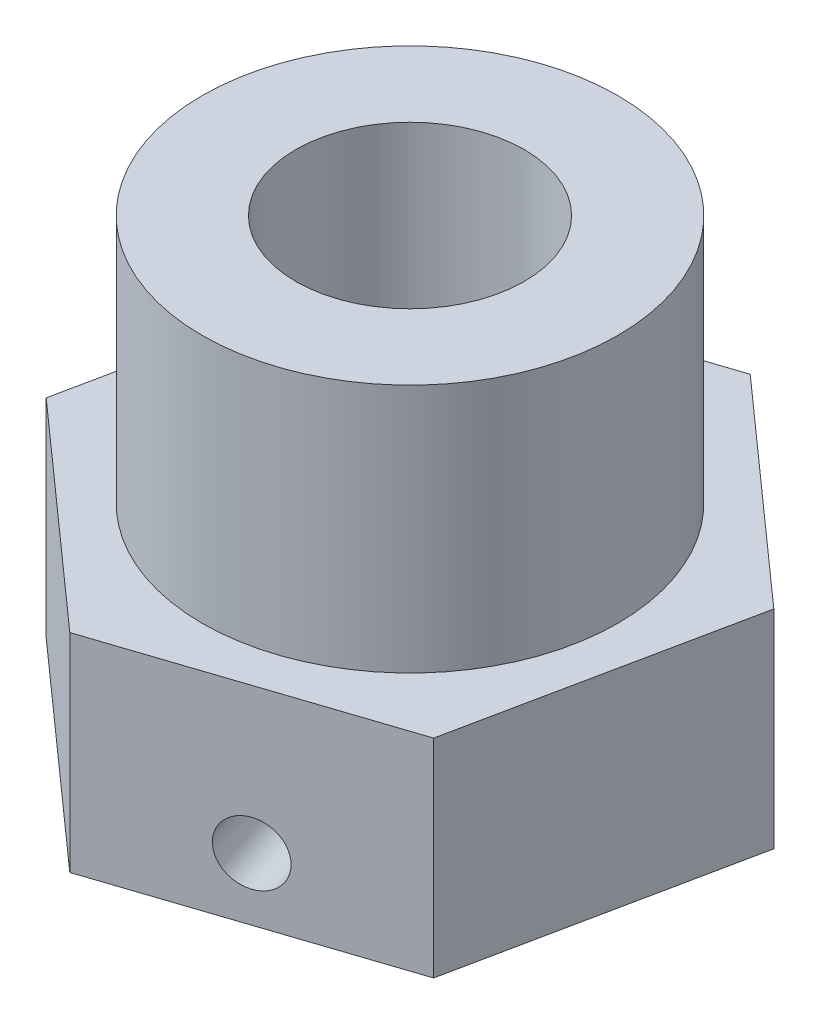
ISO-10303-21;
HEADER;
FILE_DESCRIPTION(('STEP AP214'),'2;1');
FILE_NAME('part.step','',(''),(''),'','','');
FILE_SCHEMA(('AUTOMOTIVE_DESIGN { 1 0 10303 214 1 1 1 1 }'));
ENDSEC;
DATA;
#1=APPLICATION_CONTEXT('core data for automotive mechanical design processes');
#2=APPLICATION_PROTOCOL_DEFINITION('international standard','automotive_design',2000,#1);
#3=PRODUCT_CONTEXT('',#1,'mechanical');
#4=PRODUCT('Part','Part','',(#3));
#5=PRODUCT_RELATED_PRODUCT_CATEGORY('part','',(#4));
#6=PRODUCT_DEFINITION_FORMATION('','',#4);
#7=PRODUCT_DEFINITION_CONTEXT('part definition',#1,'design');
#8=PRODUCT_DEFINITION('design','',#6,#7);
#9=PRODUCT_DEFINITION_SHAPE('','',#8);
#10=(LENGTH_UNIT() NAMED_UNIT(*) SI_UNIT(.MILLI.,.METRE.));
#11=(NAMED_UNIT(*) PLANE_ANGLE_UNIT() SI_UNIT($,.RADIAN.));
#12=(NAMED_UNIT(*) SI_UNIT($,.STERADIAN.) SOLID_ANGLE_UNIT());
#13=UNCERTAINTY_MEASURE_WITH_UNIT(LENGTH_MEASURE(1.E-05),#10,'distance_accuracy_value','');
#14=(GEOMETRIC_REPRESENTATION_CONTEXT(3) GLOBAL_UNCERTAINTY_ASSIGNED_CONTEXT((#13)) GLOBAL_UNIT_ASSIGNED_CONTEXT((#10,
#11,#12)) REPRESENTATION_CONTEXT('',''));
#15=CARTESIAN_POINT('',(0.,0.,0.));
#16=DIRECTION('',(0.,0.,1.));
#17=DIRECTION('',(1.,0.,0.));
#18=AXIS2_PLACEMENT_3D('',#15,#16,#17);
#19=CARTESIAN_POINT('',(0.,5.,0.));
#20=DIRECTION('',(0.,1.,0.));
#21=DIRECTION('',(0.,0.,1.));
#22=AXIS2_PLACEMENT_3D('',#19,#20,#21);
#23=PLANE('',#22);
#24=CARTESIAN_POINT('',(0.,5.,0.));
#25=DIRECTION('',(0.,1.,0.));
#26=DIRECTION('',(0.,0.,1.));
#27=AXIS2_PLACEMENT_3D('',#24,#25,#26);
#28=CIRCLE('',#27,5.);
#29=CARTESIAN_POINT('',(0.,5.,5.));
#30=VERTEX_POINT('',#29);
#31=EDGE_CURVE('E11',#30,#30,#28,.T.);
#32=ORIENTED_EDGE('',*,*,#31,.F.);
#33=EDGE_LOOP('',(#32));
#34=FACE_BOUND('',#33,.T.);
#35=DIRECTION('',(-0.74695648255287,0.,-0.664872930094348));
#36=VECTOR('',#35,1.);
#37=CARTESIAN_POINT('',(6.5767707382151,5.,-2.17855150431602));
#38=LINE('',#37,#36);
#39=CARTESIAN_POINT('',(6.5767707382151,5.,-2.17855150431602));
#40=VERTEX_POINT('',#39);
#41=CARTESIAN_POINT('',(1.40170442291707,5.,-6.78492628631842));
#42=VERTEX_POINT('',#41);
#43=EDGE_CURVE('E139',#40,#42,#38,.T.);
#44=ORIENTED_EDGE('',*,*,#43,.T.);
#45=DIRECTION('',(-0.949275089026735,0.,0.31444682436508));
#46=VECTOR('',#45,1.);
#47=CARTESIAN_POINT('',(1.40170442291707,5.,-6.78492628631842));
#48=LINE('',#47,#46);
#49=CARTESIAN_POINT('',(-5.17506631529803,5.,-4.6063747820024));
#50=VERTEX_POINT('',#49);
#51=EDGE_CURVE('E98',#42,#50,#48,.T.);
#52=ORIENTED_EDGE('',*,*,#51,.T.);
#53=DIRECTION('',(-0.202318606473865,0.,0.979319754459428));
#54=VECTOR('',#53,1.);
#55=CARTESIAN_POINT('',(-5.17506631529803,5.,-4.6063747820024));
#56=LINE('',#55,#54);
#57=CARTESIAN_POINT('',(-6.5767707382151,5.,2.17855150431602));
#58=VERTEX_POINT('',#57);
#59=EDGE_CURVE('E110',#50,#58,#56,.T.);
#60=ORIENTED_EDGE('',*,*,#59,.T.);
#61=DIRECTION('',(0.746956482552871,0.,0.664872930094348));
#62=VECTOR('',#61,1.);
#63=CARTESIAN_POINT('',(-6.5767707382151,5.,2.17855150431602));
#64=LINE('',#63,#62);
#65=CARTESIAN_POINT('',(-1.40170442291707,5.,6.78492628631842));
#66=VERTEX_POINT('',#65);
#67=EDGE_CURVE('E105',#58,#66,#64,.T.);
#68=ORIENTED_EDGE('',*,*,#67,.T.);
#69=DIRECTION('',(0.949275089026736,0.,-0.31444682436508));
#70=VECTOR('',#69,1.);
#71=CARTESIAN_POINT('',(-1.40170442291707,5.,6.78492628631842));
#72=LINE('',#71,#70);
#73=CARTESIAN_POINT('',(5.17506631529803,5.,4.6063747820024));
#74=VERTEX_POINT('',#73);
#75=EDGE_CURVE('E108',#66,#74,#72,.T.);
#76=ORIENTED_EDGE('',*,*,#75,.T.);
#77=DIRECTION('',(0.202318606473865,0.,-0.979319754459428));
#78=VECTOR('',#77,1.);
#79=CARTESIAN_POINT('',(5.17506631529803,5.,4.6063747820024));
#80=LINE('',#79,#78);
#81=EDGE_CURVE('E60',#74,#40,#80,.T.);
#82=ORIENTED_EDGE('',*,*,#81,.T.);
#83=EDGE_LOOP('',(#44,#52,#60,#68,#76,#82));
#84=FACE_BOUND('',#83,.T.);
#85=ADVANCED_FACE('F36',(#34,#84),#23,.T.);
#86=CARTESIAN_POINT('',(0.,0.,0.));
#87=DIRECTION('',(0.,1.,0.));
#88=DIRECTION('',(0.,0.,1.));
#89=AXIS2_PLACEMENT_3D('',#86,#87,#88);
#90=PLANE('',#89);
#91=DIRECTION('',(-0.74695648255287,0.,-0.664872930094348));
#92=VECTOR('',#91,1.);
#93=CARTESIAN_POINT('',(6.5767707382151,0.,-2.17855150431602));
#94=LINE('',#93,#92);
#95=CARTESIAN_POINT('',(6.5767707382151,0.,-2.17855150431602));
#96=VERTEX_POINT('',#95);
#97=CARTESIAN_POINT('',(1.40170442291707,0.,-6.78492628631842));
#98=VERTEX_POINT('',#97);
#99=EDGE_CURVE('E128',#96,#98,#94,.T.);
#100=ORIENTED_EDGE('',*,*,#99,.F.);
#101=DIRECTION('',(0.202318606473865,0.,-0.979319754459428));
#102=VECTOR('',#101,1.);
#103=CARTESIAN_POINT('',(5.17506631529803,0.,4.6063747820024));
#104=LINE('',#103,#102);
#105=CARTESIAN_POINT('',(5.17506631529803,0.,4.6063747820024));
#106=VERTEX_POINT('',#105);
#107=EDGE_CURVE('E89',#106,#96,#104,.T.);
#108=ORIENTED_EDGE('',*,*,#107,.F.);
#109=DIRECTION('',(0.949275089026736,0.,-0.31444682436508));
#110=VECTOR('',#109,1.);
#111=CARTESIAN_POINT('',(-1.40170442291707,0.,6.78492628631842));
#112=LINE('',#111,#110);
#113=CARTESIAN_POINT('',(-1.40170442291707,0.,6.78492628631842));
#114=VERTEX_POINT('',#113);
#115=EDGE_CURVE('E83',#114,#106,#112,.T.);
#116=ORIENTED_EDGE('',*,*,#115,.F.);
#117=DIRECTION('',(0.746956482552871,0.,0.664872930094348));
#118=VECTOR('',#117,1.);
#119=CARTESIAN_POINT('',(-6.5767707382151,0.,2.17855150431602));
#120=LINE('',#119,#118);
#121=CARTESIAN_POINT('',(-6.5767707382151,0.,2.17855150431602));
#122=VERTEX_POINT('',#121);
#123=EDGE_CURVE('E118',#122,#114,#120,.T.);
#124=ORIENTED_EDGE('',*,*,#123,.F.);
#125=DIRECTION('',(-0.202318606473865,0.,0.979319754459428));
#126=VECTOR('',#125,1.);
#127=CARTESIAN_POINT('',(-5.17506631529803,0.,-4.6063747820024));
#128=LINE('',#127,#126);
#129=CARTESIAN_POINT('',(-5.17506631529803,0.,-4.6063747820024));
#130=VERTEX_POINT('',#129);
#131=EDGE_CURVE('E134',#130,#122,#128,.T.);
#132=ORIENTED_EDGE('',*,*,#131,.F.);
#133=DIRECTION('',(-0.949275089026735,0.,0.31444682436508));
#134=VECTOR('',#133,1.);
#135=CARTESIAN_POINT('',(1.40170442291707,0.,-6.78492628631842));
#136=LINE('',#135,#134);
#137=EDGE_CURVE('E131',#98,#130,#136,.T.);
#138=ORIENTED_EDGE('',*,*,#137,.F.);
#139=EDGE_LOOP('',(#100,#108,#116,#124,#132,#138));
#140=FACE_BOUND('',#139,.T.);
#141=CARTESIAN_POINT('',(0.,0.,0.));
#142=DIRECTION('',(0.,1.,0.));
#143=DIRECTION('',(0.,0.,1.));
#144=AXIS2_PLACEMENT_3D('',#141,#142,#143);
#145=CIRCLE('',#144,2.75);
#146=CARTESIAN_POINT('',(0.,0.,2.75));
#147=VERTEX_POINT('',#146);
#148=EDGE_CURVE('E132',#147,#147,#145,.T.);
#149=ORIENTED_EDGE('',*,*,#148,.T.);
#150=EDGE_LOOP('',(#149));
#151=FACE_BOUND('',#150,.T.);
#152=ADVANCED_FACE('F174',(#140,#151),#90,.F.);
#153=CARTESIAN_POINT('',(6.5767707382151,5.,-2.17855150431602));
#154=DIRECTION('',(-0.664872930094348,0.,0.74695648255287));
#155=DIRECTION('',(0.746956482552871,0.,0.664872930094348));
#156=AXIS2_PLACEMENT_3D('',#153,#154,#155);
#157=PLANE('',#156);
#158=ORIENTED_EDGE('',*,*,#99,.T.);
#159=DIRECTION('',(0.,-1.,0.));
#160=VECTOR('',#159,1.);
#161=CARTESIAN_POINT('',(1.40170442291707,5.,-6.78492628631842));
#162=LINE('',#161,#160);
#163=EDGE_CURVE('E51',#42,#98,#162,.T.);
#164=ORIENTED_EDGE('',*,*,#163,.F.);
#165=ORIENTED_EDGE('',*,*,#43,.F.);
#166=DIRECTION('',(0.,-1.,0.));
#167=VECTOR('',#166,1.);
#168=CARTESIAN_POINT('',(6.5767707382151,5.,-2.17855150431602));
#169=LINE('',#168,#167);
#170=EDGE_CURVE('E124',#40,#96,#169,.T.);
#171=ORIENTED_EDGE('',*,*,#170,.T.);
#172=EDGE_LOOP('',(#158,#164,#165,#171));
#173=FACE_BOUND('',#172,.T.);
#174=ADVANCED_FACE('F38',(#173),#157,.F.);
#175=CARTESIAN_POINT('',(1.40170442291707,5.,-6.78492628631842));
#176=DIRECTION('',(0.31444682436508,0.,0.949275089026736));
#177=DIRECTION('',(0.949275089026736,0.,-0.31444682436508));
#178=AXIS2_PLACEMENT_3D('',#175,#176,#177);
#179=PLANE('',#178);
#180=CARTESIAN_POINT('',(-1.88668094619048,1.5,-5.69565053416041));
#181=DIRECTION('',(0.31444682436508,0.,0.949275089026736));
#182=DIRECTION('',(0.949275089026736,0.,-0.31444682436508));
#183=AXIS2_PLACEMENT_3D('',#180,#181,#182);
#184=CIRCLE('',#183,0.75);
#185=CARTESIAN_POINT('',(-1.17472462942043,1.5,-5.93148565243422));
#186=VERTEX_POINT('',#185);
#187=EDGE_CURVE('E203',#186,#186,#184,.T.);
#188=ORIENTED_EDGE('',*,*,#187,.T.);
#189=EDGE_LOOP('',(#188));
#190=FACE_BOUND('',#189,.T.);
#191=ORIENTED_EDGE('',*,*,#137,.T.);
#192=DIRECTION('',(0.,-1.,0.));
#193=VECTOR('',#192,1.);
#194=CARTESIAN_POINT('',(-5.17506631529803,5.,-4.6063747820024));
#195=LINE('',#194,#193);
#196=EDGE_CURVE('E143',#50,#130,#195,.T.);
#197=ORIENTED_EDGE('',*,*,#196,.F.);
#198=ORIENTED_EDGE('',*,*,#51,.F.);
#199=ORIENTED_EDGE('',*,*,#163,.T.);
#200=EDGE_LOOP('',(#191,#197,#198,#199));
#201=FACE_BOUND('',#200,.T.);
#202=ADVANCED_FACE('F193',(#190,#201),#179,.F.);
#203=CARTESIAN_POINT('',(-5.17506631529803,5.,-4.6063747820024));
#204=DIRECTION('',(0.979319754459428,0.,0.202318606473865));
#205=DIRECTION('',(0.202318606473865,0.,-0.979319754459428));
#206=AXIS2_PLACEMENT_3D('',#203,#204,#205);
#207=PLANE('',#206);
#208=ORIENTED_EDGE('',*,*,#131,.T.);
#209=DIRECTION('',(0.,-1.,0.));
#210=VECTOR('',#209,1.);
#211=CARTESIAN_POINT('',(-6.5767707382151,5.,2.17855150431602));
#212=LINE('',#211,#210);
#213=EDGE_CURVE('E119',#58,#122,#212,.T.);
#214=ORIENTED_EDGE('',*,*,#213,.F.);
#215=ORIENTED_EDGE('',*,*,#59,.F.);
#216=ORIENTED_EDGE('',*,*,#196,.T.);
#217=EDGE_LOOP('',(#208,#214,#215,#216));
#218=FACE_BOUND('',#217,.T.);
#219=ADVANCED_FACE('F191',(#218),#207,.F.);
#220=CARTESIAN_POINT('',(-6.5767707382151,5.,2.17855150431602));
#221=DIRECTION('',(0.664872930094348,0.,-0.746956482552871));
#222=DIRECTION('',(-0.746956482552871,0.,-0.664872930094348));
#223=AXIS2_PLACEMENT_3D('',#220,#221,#222);
#224=PLANE('',#223);
#225=ORIENTED_EDGE('',*,*,#123,.T.);
#226=DIRECTION('',(0.,-1.,0.));
#227=VECTOR('',#226,1.);
#228=CARTESIAN_POINT('',(-1.40170442291707,5.,6.78492628631842));
#229=LINE('',#228,#227);
#230=EDGE_CURVE('E115',#66,#114,#229,.T.);
#231=ORIENTED_EDGE('',*,*,#230,.F.);
#232=ORIENTED_EDGE('',*,*,#67,.F.);
#233=ORIENTED_EDGE('',*,*,#213,.T.);
#234=EDGE_LOOP('',(#225,#231,#232,#233));
#235=FACE_BOUND('',#234,.T.);
#236=ADVANCED_FACE('F116',(#235),#224,.F.);
#237=CARTESIAN_POINT('',(-1.40170442291707,5.,6.78492628631842));
#238=DIRECTION('',(-0.31444682436508,0.,-0.949275089026736));
#239=DIRECTION('',(-0.949275089026735,0.,0.31444682436508));
#240=AXIS2_PLACEMENT_3D('',#237,#238,#239);
#241=PLANE('',#240);
#242=CARTESIAN_POINT('',(1.88668094619048,1.5,5.69565053416041));
#243=DIRECTION('',(0.31444682436508,0.,0.949275089026736));
#244=DIRECTION('',(0.949275089026735,0.,-0.31444682436508));
#245=AXIS2_PLACEMENT_3D('',#242,#243,#244);
#246=CIRCLE('',#245,0.75);
#247=CARTESIAN_POINT('',(2.59863726296053,1.5,5.4598154158866));
#248=VERTEX_POINT('',#247);
#249=EDGE_CURVE('E151',#248,#248,#246,.T.);
#250=ORIENTED_EDGE('',*,*,#249,.F.);
#251=EDGE_LOOP('',(#250));
#252=FACE_BOUND('',#251,.T.);
#253=ORIENTED_EDGE('',*,*,#115,.T.);
#254=DIRECTION('',(0.,-1.,0.));
#255=VECTOR('',#254,1.);
#256=CARTESIAN_POINT('',(5.17506631529803,5.,4.6063747820024));
#257=LINE('',#256,#255);
#258=EDGE_CURVE('E120',#74,#106,#257,.T.);
#259=ORIENTED_EDGE('',*,*,#258,.F.);
#260=ORIENTED_EDGE('',*,*,#75,.F.);
#261=ORIENTED_EDGE('',*,*,#230,.T.);
#262=EDGE_LOOP('',(#253,#259,#260,#261));
#263=FACE_BOUND('',#262,.T.);
#264=ADVANCED_FACE('F122',(#252,#263),#241,.F.);
#265=CARTESIAN_POINT('',(5.17506631529803,5.,4.6063747820024));
#266=DIRECTION('',(-0.979319754459428,0.,-0.202318606473865));
#267=DIRECTION('',(-0.202318606473865,0.,0.979319754459428));
#268=AXIS2_PLACEMENT_3D('',#265,#266,#267);
#269=PLANE('',#268);
#270=ORIENTED_EDGE('',*,*,#107,.T.);
#271=ORIENTED_EDGE('',*,*,#170,.F.);
#272=ORIENTED_EDGE('',*,*,#81,.F.);
#273=ORIENTED_EDGE('',*,*,#258,.T.);
#274=EDGE_LOOP('',(#270,#271,#272,#273));
#275=FACE_BOUND('',#274,.T.);
#276=ADVANCED_FACE('F183',(#275),#269,.F.);
#277=CARTESIAN_POINT('',(0.,5.,0.));
#278=DIRECTION('',(0.,-1.,0.));
#279=DIRECTION('',(0.,0.,-1.));
#280=AXIS2_PLACEMENT_3D('',#277,#278,#279);
#281=CYLINDRICAL_SURFACE('',#280,2.75);
#282=CARTESIAN_POINT('',(-0.119991781053955,1.5,-2.74738092962725));
#283=CARTESIAN_POINT('',(-0.119992869265209,1.54127822550266,-2.74738128421438));
#284=CARTESIAN_POINT('',(-0.123544807204557,1.58256605494395,-2.74723275563));
#285=CARTESIAN_POINT('',(-0.13760367134907,1.66394676261868,-2.7465638811396));
#286=CARTESIAN_POINT('',(-0.148113878919327,1.70403906774304,-2.74604335980087));
#287=CARTESIAN_POINT('',(-0.175639975036804,1.78183959399195,-2.74441959397495));
#288=CARTESIAN_POINT('',(-0.192646429255946,1.81955118045507,-2.743317193653));
#289=CARTESIAN_POINT('',(-0.232539712276566,1.8916790671154,-2.74022333642707));
#290=CARTESIAN_POINT('',(-0.255427074291777,1.92609506811785,-2.73823179889417));
#291=CARTESIAN_POINT('',(-0.306934429047363,1.99155510339649,-2.73294264770961));
#292=CARTESIAN_POINT('',(-0.335677175534498,2.02250016418924,-2.72961526488655));
#293=CARTESIAN_POINT('',(-0.397638700541994,2.07926382886253,-2.72127895769866));
#294=CARTESIAN_POINT('',(-0.430857960629335,2.10508188045795,-2.71626985233369));
#295=CARTESIAN_POINT('',(-0.501369532363693,2.1512743134053,-2.70415007495862));
#296=CARTESIAN_POINT('',(-0.538720939174285,2.17154986091324,-2.69700548182245));
#297=CARTESIAN_POINT('',(-0.615864036662647,2.20543643409142,-2.68044126685463));
#298=CARTESIAN_POINT('',(-0.655655294777948,2.21904863728711,-2.6710220474275));
#299=CARTESIAN_POINT('',(-0.735449840406022,2.23890054914027,-2.65014582460092));
#300=CARTESIAN_POINT('',(-0.775425319576893,2.24530872210737,-2.6387429183296));
#301=CARTESIAN_POINT('',(-0.85526744812151,2.25110115114898,-2.61395554035008));
#302=CARTESIAN_POINT('',(-0.895134115296764,2.25048663477224,-2.60057141535773));
#303=CARTESIAN_POINT('',(-0.972526575715359,2.2423688006758,-2.57261374168804));
#304=CARTESIAN_POINT('',(-1.0100863752855,2.23504756334037,-2.5580808638574));
#305=CARTESIAN_POINT('',(-1.08297773423876,2.21401883382721,-2.52808494485594));
#306=CARTESIAN_POINT('',(-1.11830916358088,2.20031096933583,-2.5126218495031));
#307=CARTESIAN_POINT('',(-1.186248296024,2.16676143207849,-2.48127593574512));
#308=CARTESIAN_POINT('',(-1.2188243381057,2.14685827565615,-2.4653904388533));
#309=CARTESIAN_POINT('',(-1.28014911455977,2.1015305528663,-2.43411276900692));
#310=CARTESIAN_POINT('',(-1.30889707158076,2.07610486781433,-2.41872069673015));
#311=CARTESIAN_POINT('',(-1.36285487408932,2.01949100243957,-2.38874667940729));
#312=CARTESIAN_POINT('',(-1.3879216792516,1.98814416402961,-2.37420654774224));
#313=CARTESIAN_POINT('',(-1.43287053242837,1.92107739244333,-2.34735371334807));
#314=CARTESIAN_POINT('',(-1.45275223354111,1.88535716690681,-2.33504115966862));
#315=CARTESIAN_POINT('',(-1.48701892846695,1.81022280299982,-2.31337207058945));
#316=CARTESIAN_POINT('',(-1.50136616280616,1.7707854971129,-2.30403591436777));
#317=CARTESIAN_POINT('',(-1.52401920565015,1.68953869888545,-2.28911587684208));
#318=CARTESIAN_POINT('',(-1.53232659203611,1.64772982918359,-2.2835310155594));
#319=CARTESIAN_POINT('',(-1.54251785927161,1.56432390924501,-2.27665885108003));
#320=CARTESIAN_POINT('',(-1.54459396312968,1.52276090661795,-2.27524296989584));
#321=CARTESIAN_POINT('',(-1.54281344024978,1.43982442822897,-2.27645072973789));
#322=CARTESIAN_POINT('',(-1.5389574781015,1.39845093175686,-2.27907391825334));
#323=CARTESIAN_POINT('',(-1.52555654507853,1.31793878134432,-2.28806456159513));
#324=CARTESIAN_POINT('',(-1.51612886148623,1.27877178968511,-2.2943547875644));
#325=CARTESIAN_POINT('',(-1.49190663516648,1.20282699503469,-2.31017802832437));
#326=CARTESIAN_POINT('',(-1.47711136805495,1.16604951531116,-2.31971148079499));
#327=CARTESIAN_POINT('',(-1.44207218021366,1.09499964591651,-2.34165822741856));
#328=CARTESIAN_POINT('',(-1.42171146804599,1.06080371274751,-2.35413235582387));
#329=CARTESIAN_POINT('',(-1.37611171606809,0.99671696730743,-2.38107465444924));
#330=CARTESIAN_POINT('',(-1.35087171547881,0.966827004949937,-2.39554321723144));
#331=CARTESIAN_POINT('',(-1.29516171178115,0.9112668180247,-2.42612743599771));
#332=CARTESIAN_POINT('',(-1.26455604136095,0.885752498282901,-2.44227979256291));
#333=CARTESIAN_POINT('',(-1.19933233722458,0.840814682454508,-2.47496069966509));
#334=CARTESIAN_POINT('',(-1.16471451710039,0.821390862336091,-2.49148923013836));
#335=CARTESIAN_POINT('',(-1.09256622078633,0.789366466871042,-2.523955295243));
#336=CARTESIAN_POINT('',(-1.05506019777867,0.776714554849753,-2.53989639795164));
#337=CARTESIAN_POINT('',(-0.977909991627748,0.758446523727461,-2.57058618300017));
#338=CARTESIAN_POINT('',(-0.938266308064048,0.752828768086536,-2.5853351419524));
#339=CARTESIAN_POINT('',(-0.859298779096201,0.748894939954714,-2.61262229798927));
#340=CARTESIAN_POINT('',(-0.820005390489926,0.750350664346646,-2.62521619157428));
#341=CARTESIAN_POINT('',(-0.741661080741619,0.759989888654994,-2.64841612711077));
#342=CARTESIAN_POINT('',(-0.702610149803954,0.76817311496514,-2.65902224988298));
#343=CARTESIAN_POINT('',(-0.626195119817657,0.790903685169736,-2.67804404341428));
#344=CARTESIAN_POINT('',(-0.58882056805343,0.805402849120119,-2.68647554244787));
#345=CARTESIAN_POINT('',(-0.516509920481432,0.840310810767553,-2.70131106356245));
#346=CARTESIAN_POINT('',(-0.48157417938673,0.860720465903311,-2.70771479119099));
#347=CARTESIAN_POINT('',(-0.414199209762214,0.907527364140849,-2.71884866716589));
#348=CARTESIAN_POINT('',(-0.381855696918452,0.934074536218315,-2.72352765534615));
#349=CARTESIAN_POINT('',(-0.321730745206212,0.992121069275122,-2.731283626406));
#350=CARTESIAN_POINT('',(-0.293950527532646,1.02362175147567,-2.73436018093092));
#351=CARTESIAN_POINT('',(-0.243246337046108,1.09156376341543,-2.73934240011358));
#352=CARTESIAN_POINT('',(-0.220450583063217,1.12810310134028,-2.74121911564379));
#353=CARTESIAN_POINT('',(-0.181399987546301,1.20454297257493,-2.74408088739596));
#354=CARTESIAN_POINT('',(-0.165141056125258,1.24444138525562,-2.74506650163596));
#355=CARTESIAN_POINT('',(-0.141763456630668,1.32013400962588,-2.74636443035562));
#356=CARTESIAN_POINT('',(-0.133622884239281,1.35561423437439,-2.74675704927633));
#357=CARTESIAN_POINT('',(-0.122736909229243,1.42739389895273,-2.74726512543518));
#358=CARTESIAN_POINT('',(-0.119990823904507,1.46369323453073,-2.74738061774583));
#359=CARTESIAN_POINT('',(-0.119991781053955,1.5,-2.74738092962725));
#360=B_SPLINE_CURVE_WITH_KNOTS('',3,(#282,#283,#284,#285,#286,#287,#288,#289,#290,#291,#292,
#293,#294,#295,#296,#297,#298,#299,#300,#301,#302,#303,#304,#305,#306,#307,#308,#309,#310,#311,
#312,#313,#314,#315,#316,#317,#318,#319,#320,#321,#322,#323,#324,#325,#326,#327,#328,#329,#330,
#331,#332,#333,#334,#335,#336,#337,#338,#339,#340,#341,#342,#343,#344,#345,#346,#347,#348,#349,
#350,#351,#352,#353,#354,#355,#356,#357,#358,#359),.UNSPECIFIED.,.T.,.F.,(4,2,2,2,2,2,2,2,2,2,2,
2,2,2,2,2,2,2,2,2,2,2,2,2,2,2,2,2,2,2,2,2,2,2,2,2,2,2,4),(0.,0.12370110067969,0.247460577636812,
0.371041001114147,0.494632633412867,0.621146634972569,0.747674257327461,0.876329414066369,
1.00496182705167,1.13051921507375,1.25605465631036,1.37827981189676,1.50051209359009,
1.62399834853403,1.74750964113961,1.87498208429956,2.00246305362873,2.13079900912157,
2.25910142540551,2.38340305767265,2.50769076501635,2.62945093720513,2.75122754769593,
2.87578712741458,3.00037125914755,3.12874278335119,3.25710747666703,3.38448475880956,
3.51183240033097,3.63509938017071,3.75836134701295,3.88069906276589,4.00305453502713,
4.12879252694222,4.25456411329071,4.38326590609935,4.51188704840582,4.62070362887508,
4.72950643703791),.UNSPECIFIED.);
#361=CARTESIAN_POINT('',(-0.119991781053955,1.5,-2.74738092962725));
#362=VERTEX_POINT('',#361);
#363=EDGE_CURVE('E40',#362,#362,#360,.T.);
#364=ORIENTED_EDGE('',*,*,#363,.F.);
#365=EDGE_LOOP('',(#364));
#366=FACE_BOUND('',#365,.T.);
#367=CARTESIAN_POINT('',(1.54390441459406,1.5,2.27571069307963));
#368=CARTESIAN_POINT('',(1.54390375326657,1.45872177449734,2.27571162720046));
#369=CARTESIAN_POINT('',(1.54096555334351,1.41743394505605,2.27771295303037));
#370=CARTESIAN_POINT('',(1.52928756690761,1.33605323738132,2.28556939541358));
#371=CARTESIAN_POINT('',(1.52054504319935,1.29596093225696,2.29142633017884));
#372=CARTESIAN_POINT('',(1.49749295502526,1.21816040600805,2.30655655865497));
#373=CARTESIAN_POINT('',(1.48319146317587,1.18044881954493,2.31582489736584));
#374=CARTESIAN_POINT('',(1.44934020957849,1.1083209328846,2.3371588752552));
#375=CARTESIAN_POINT('',(1.42978997192681,1.07390493188215,2.34922476807435));
#376=CARTESIAN_POINT('',(1.38531079592552,1.00844489660351,2.37573109970317));
#377=CARTESIAN_POINT('',(1.36026560683664,0.977499835810756,2.39022093943924));
#378=CARTESIAN_POINT('',(1.30558047946713,0.920736171137474,2.42052376840563));
#379=CARTESIAN_POINT('',(1.2759400467953,0.894918119542053,2.43633689992139));
#380=CARTESIAN_POINT('',(1.21213696981198,0.8487256865947,2.46870877227272));
#381=CARTESIAN_POINT('',(1.17790666594155,0.82845013908676,2.48527557941079));
#382=CARTESIAN_POINT('',(1.10613017290416,0.794563565908583,2.51804089269866));
#383=CARTESIAN_POINT('',(1.06858457099159,0.780951362712895,2.53423946343925));
#384=CARTESIAN_POINT('',(0.992106724429343,0.761099450859726,2.56512838016834));
#385=CARTESIAN_POINT('',(0.953229084532376,0.754691277892633,2.57984552399502));
#386=CARTESIAN_POINT('',(0.874378132207979,0.748898848851024,2.60762513729632));
#387=CARTESIAN_POINT('',(0.834405012486308,0.749513365227762,2.62068789554986));
#388=CARTESIAN_POINT('',(0.755626653000188,0.757631199324198,2.64446171567496));
#389=CARTESIAN_POINT('',(0.716818411996659,0.764952436659629,2.655225707128));
#390=CARTESIAN_POINT('',(0.640434226561974,0.785981166172793,2.67467722589328));
#391=CARTESIAN_POINT('',(0.602858354109463,0.79968903066417,2.68336463210459));
#392=CARTESIAN_POINT('',(0.529641136991403,0.83323856792151,2.69877667752152));
#393=CARTESIAN_POINT('',(0.494023593226277,0.85314172434385,2.70548026651163));
#394=CARTESIAN_POINT('',(0.426153460460539,0.8984694471337,2.71699833564325));
#395=CARTESIAN_POINT('',(0.393901555191191,0.923895132185671,2.72181243247976));
#396=CARTESIAN_POINT('',(0.332719822201195,0.980508997560429,2.72997831971662));
#397=CARTESIAN_POINT('',(0.303929710363931,1.01185583597039,2.73327826066736));
#398=CARTESIAN_POINT('',(0.251838699039015,1.07892260755667,2.73856982528049));
#399=CARTESIAN_POINT('',(0.22853816683366,1.11464283309319,2.74056136141952));
#400=CARTESIAN_POINT('',(0.188111538447855,1.18977719700018,2.74363439249932));
#401=CARTESIAN_POINT('',(0.171027900897141,1.2292145028871,2.74470969441771));
#402=CARTESIAN_POINT('',(0.143947419996615,1.31046130111455,2.74626385787625));
#403=CARTESIAN_POINT('',(0.133948725756847,1.35227017081641,2.74674287521618));
#404=CARTESIAN_POINT('',(0.121670183814602,1.43567609075499,2.7473138220348));
#405=CARTESIAN_POINT('',(0.119159365729561,1.47723909338205,2.74741735609208));
#406=CARTESIAN_POINT('',(0.121308808042231,1.56017557177103,2.74732331723641));
#407=CARTESIAN_POINT('',(0.125968265129478,1.60154906824314,2.74712577805375));
#408=CARTESIAN_POINT('',(0.142086467069649,1.68206121865568,2.7463382250071));
#409=CARTESIAN_POINT('',(0.153405013530953,1.7212282103149,2.74575627426667));
#410=CARTESIAN_POINT('',(0.18228357228468,1.79717300496531,2.74398991067415));
#411=CARTESIAN_POINT('',(0.199844427003487,1.83395048468884,2.74280541649693));
#412=CARTESIAN_POINT('',(0.241056544672534,1.90500035408349,2.73949396225904));
#413=CARTESIAN_POINT('',(0.264837820759467,1.93919628725249,2.73734608257811));
#414=CARTESIAN_POINT('',(0.317504422823816,2.00328303269257,2.73173770824502));
#415=CARTESIAN_POINT('',(0.346390753939637,2.03317299505006,2.72827695494599));
#416=CARTESIAN_POINT('',(0.409342470042599,2.0887331819753,2.71955454763903));
#417=CARTESIAN_POINT('',(0.443538603633553,2.1142475017171,2.71424134409422));
#418=CARTESIAN_POINT('',(0.515374359977975,2.15918531754549,2.70152138416053));
#419=CARTESIAN_POINT('',(0.553013799400148,2.17860913766391,2.69411473918853));
#420=CARTESIAN_POINT('',(0.630276525631834,2.21063353312896,2.677088489465));
#421=CARTESIAN_POINT('',(0.669882325081628,2.22328544515025,2.667486345571));
#422=CARTESIAN_POINT('',(0.750097388527835,2.24155347627254,2.64604897605476));
#423=CARTESIAN_POINT('',(0.790706416874003,2.24717123191347,2.63421427058933));
#424=CARTESIAN_POINT('',(0.870348075033599,2.25110506004529,2.60896222509875));
#425=CARTESIAN_POINT('',(0.909389521415904,2.24964933565335,2.59560774988735));
#426=CARTESIAN_POINT('',(0.986091161874673,2.24001011134501,2.567448804066));
#427=CARTESIAN_POINT('',(1.02375141205907,2.23182688503486,2.55264439244627));
#428=CARTESIAN_POINT('',(1.09641097295392,2.20909631483026,2.52228531394376));
#429=CARTESIAN_POINT('',(1.13142811868798,2.19459715087988,2.50673710503824));
#430=CARTESIAN_POINT('',(1.19829577797041,2.15968918923245,2.47546989248081));
#431=CARTESIAN_POINT('',(1.23014583116542,2.13927953409669,2.45975086436672));
#432=CARTESIAN_POINT('',(1.29084400412354,2.09247263585915,2.42846058591358));
#433=CARTESIAN_POINT('',(1.31958479405827,2.06592546378168,2.41290543411767));
#434=CARTESIAN_POINT('',(1.37245008048373,2.00787893072488,2.38323345412586));
#435=CARTESIAN_POINT('',(1.39657334155048,1.97637824852433,2.36911701132886));
#436=CARTESIAN_POINT('',(1.44022494563747,1.90843623658457,2.34284392811598));
#437=CARTESIAN_POINT('',(1.4596331431356,1.87189689865972,2.33074060912061));
#438=CARTESIAN_POINT('',(1.49266980030533,1.79545702742507,2.3097235201015));
#439=CARTESIAN_POINT('',(1.50630187420692,1.75555861474438,2.30080775611149));
#440=CARTESIAN_POINT('',(1.52583132344849,1.67986599037412,2.28789274974633));
#441=CARTESIAN_POINT('',(1.5325964590328,1.64438576562561,2.28334786151864));
#442=CARTESIAN_POINT('',(1.54163301112663,1.57260610104727,2.27725661209362));
#443=CARTESIAN_POINT('',(1.5439049962727,1.53630676546927,2.2757098714623));
#444=CARTESIAN_POINT('',(1.54390441459406,1.5,2.27571069307963));
#445=B_SPLINE_CURVE_WITH_KNOTS('',3,(#367,#368,#369,#370,#371,#372,#373,#374,#375,#376,#377,
#378,#379,#380,#381,#382,#383,#384,#385,#386,#387,#388,#389,#390,#391,#392,#393,#394,#395,#396,
#397,#398,#399,#400,#401,#402,#403,#404,#405,#406,#407,#408,#409,#410,#411,#412,#413,#414,#415,
#416,#417,#418,#419,#420,#421,#422,#423,#424,#425,#426,#427,#428,#429,#430,#431,#432,#433,#434,
#435,#436,#437,#438,#439,#440,#441,#442,#443,#444),.UNSPECIFIED.,.T.,.F.,(4,2,2,2,2,2,2,2,2,2,2,
2,2,2,2,2,2,2,2,2,2,2,2,2,2,2,2,2,2,2,2,2,2,2,2,2,2,2,4),(0.,0.12370110067969,0.247460577636813,
0.371041001114147,0.494632633412868,0.621146634972569,0.747674257327461,0.876329414066369,
1.00496182705167,1.13051921507375,1.25605465631036,1.37827981189676,1.50051209359009,
1.62399834853403,1.74750964113961,1.87498208429956,2.00246305362873,2.13079900912157,
2.25910142540551,2.38340305767265,2.50769076501635,2.62945093720513,2.75122754769593,
2.87578712741458,3.00037125914755,3.12874278335119,3.25710747666703,3.38448475880956,
3.51183240033097,3.63509938017071,3.75836134701295,3.88069906276589,4.00305453502713,
4.12879252694222,4.25456411329072,4.38326590609935,4.51188704840582,4.62070362887508,
4.72950643703791),.UNSPECIFIED.);
#446=CARTESIAN_POINT('',(1.54390441459406,1.5,2.27571069307963));
#447=VERTEX_POINT('',#446);
#448=EDGE_CURVE('E146',#447,#447,#445,.T.);
#449=ORIENTED_EDGE('',*,*,#448,.F.);
#450=EDGE_LOOP('',(#449));
#451=FACE_BOUND('',#450,.T.);
#452=ORIENTED_EDGE('',*,*,#148,.F.);
#453=EDGE_LOOP('',(#452));
#454=FACE_BOUND('',#453,.T.);
#455=CARTESIAN_POINT('',(0.,11.,0.));
#456=DIRECTION('',(0.,1.,0.));
#457=DIRECTION('',(0.,0.,1.));
#458=AXIS2_PLACEMENT_3D('',#455,#456,#457);
#459=CIRCLE('',#458,2.75);
#460=CARTESIAN_POINT('',(0.,11.,2.75));
#461=VERTEX_POINT('',#460);
#462=EDGE_CURVE('E217',#461,#461,#459,.T.);
#463=ORIENTED_EDGE('',*,*,#462,.T.);
#464=EDGE_LOOP('',(#463));
#465=FACE_BOUND('',#464,.T.);
#466=ADVANCED_FACE('F152',(#366,#451,#454,#465),#281,.F.);
#467=CARTESIAN_POINT('',(0.,11.,0.));
#468=DIRECTION('',(0.,1.,0.));
#469=DIRECTION('',(0.,0.,1.));
#470=AXIS2_PLACEMENT_3D('',#467,#468,#469);
#471=PLANE('',#470);
#472=CARTESIAN_POINT('',(0.,11.,0.));
#473=DIRECTION('',(0.,1.,0.));
#474=DIRECTION('',(0.,0.,1.));
#475=AXIS2_PLACEMENT_3D('',#472,#473,#474);
#476=CIRCLE('',#475,5.);
#477=CARTESIAN_POINT('',(0.,11.,5.));
#478=VERTEX_POINT('',#477);
#479=EDGE_CURVE('E213',#478,#478,#476,.T.);
#480=ORIENTED_EDGE('',*,*,#479,.T.);
#481=EDGE_LOOP('',(#480));
#482=FACE_BOUND('',#481,.T.);
#483=ORIENTED_EDGE('',*,*,#462,.F.);
#484=EDGE_LOOP('',(#483));
#485=FACE_BOUND('',#484,.T.);
#486=ADVANCED_FACE('F163',(#482,#485),#471,.T.);
#487=CARTESIAN_POINT('',(0.,11.,0.));
#488=DIRECTION('',(0.,-1.,0.));
#489=DIRECTION('',(0.,0.,-1.));
#490=AXIS2_PLACEMENT_3D('',#487,#488,#489);
#491=CYLINDRICAL_SURFACE('',#490,5.);
#492=ORIENTED_EDGE('',*,*,#479,.F.);
#493=EDGE_LOOP('',(#492));
#494=FACE_BOUND('',#493,.T.);
#495=ORIENTED_EDGE('',*,*,#31,.T.);
#496=EDGE_LOOP('',(#495));
#497=FACE_BOUND('',#496,.T.);
#498=ADVANCED_FACE('F161',(#494,#497),#491,.T.);
#499=CARTESIAN_POINT('',(-2.67556708171375,1.5,-8.07719774184141));
#500=DIRECTION('',(0.31444682436508,0.,0.949275089026735));
#501=DIRECTION('',(0.949275089026736,0.,-0.31444682436508));
#502=AXIS2_PLACEMENT_3D('',#499,#500,#501);
#503=CYLINDRICAL_SURFACE('',#502,0.75);
#504=ORIENTED_EDGE('',*,*,#448,.T.);
#505=EDGE_LOOP('',(#504));
#506=FACE_BOUND('',#505,.T.);
#507=ORIENTED_EDGE('',*,*,#249,.T.);
#508=EDGE_LOOP('',(#507));
#509=FACE_BOUND('',#508,.T.);
#510=ADVANCED_FACE('F156',(#506,#509),#503,.F.);
#511=ORIENTED_EDGE('',*,*,#363,.T.);
#512=EDGE_LOOP('',(#511));
#513=FACE_BOUND('',#512,.T.);
#514=ORIENTED_EDGE('',*,*,#187,.F.);
#515=EDGE_LOOP('',(#514));
#516=FACE_BOUND('',#515,.T.);
#517=ADVANCED_FACE('F160',(#513,#516),#503,.F.);
#518=CLOSED_SHELL('',(#85,#152,#174,#202,#219,#236,#264,#276,#466,#486,#498,#510,#517));
#519=MANIFOLD_SOLID_BREP('B2',#518);
#520=ADVANCED_BREP_SHAPE_REPRESENTATION('',(#18,#519),#14);
#521=SHAPE_DEFINITION_REPRESENTATION(#9,#520);
ENDSEC;
END-ISO-10303-21;
